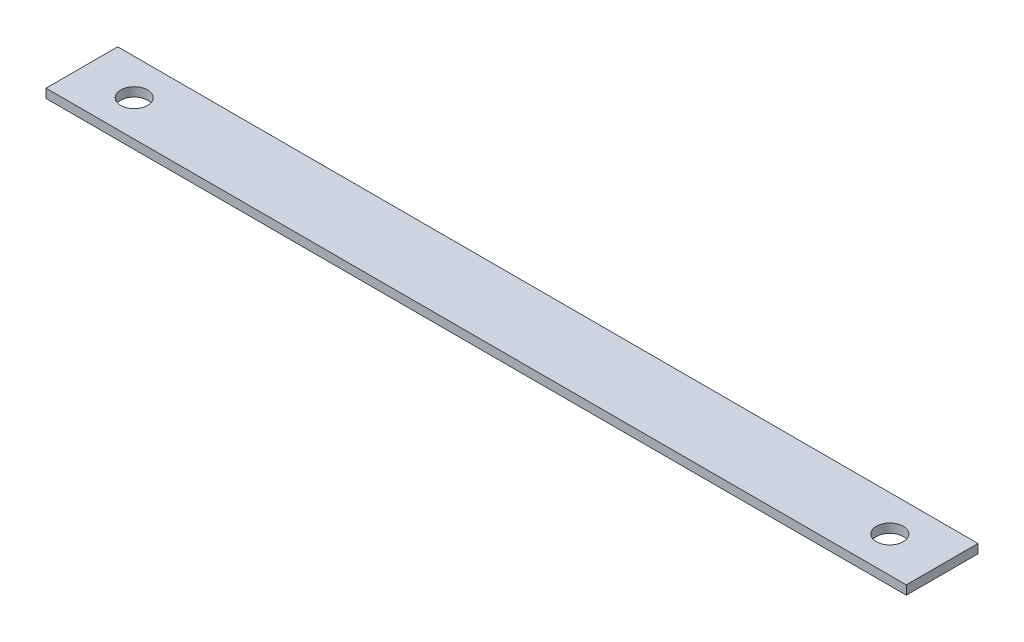
ISO-10303-21;
HEADER;
FILE_DESCRIPTION(('STEP AP214'),'2;1');
FILE_NAME('part.step','',(''),(''),'','','');
FILE_SCHEMA(('AUTOMOTIVE_DESIGN { 1 0 10303 214 1 1 1 1 }'));
ENDSEC;
DATA;
#1=APPLICATION_CONTEXT('core data for automotive mechanical design processes');
#2=APPLICATION_PROTOCOL_DEFINITION('international standard','automotive_design',2000,#1);
#3=PRODUCT_CONTEXT('',#1,'mechanical');
#4=PRODUCT('Part','Part','',(#3));
#5=PRODUCT_RELATED_PRODUCT_CATEGORY('part','',(#4));
#6=PRODUCT_DEFINITION_FORMATION('','',#4);
#7=PRODUCT_DEFINITION_CONTEXT('part definition',#1,'design');
#8=PRODUCT_DEFINITION('design','',#6,#7);
#9=PRODUCT_DEFINITION_SHAPE('','',#8);
#10=(LENGTH_UNIT() NAMED_UNIT(*) SI_UNIT(.MILLI.,.METRE.));
#11=(NAMED_UNIT(*) PLANE_ANGLE_UNIT() SI_UNIT($,.RADIAN.));
#12=(NAMED_UNIT(*) SI_UNIT($,.STERADIAN.) SOLID_ANGLE_UNIT());
#13=UNCERTAINTY_MEASURE_WITH_UNIT(LENGTH_MEASURE(1.E-05),#10,'distance_accuracy_value','');
#14=(GEOMETRIC_REPRESENTATION_CONTEXT(3) GLOBAL_UNCERTAINTY_ASSIGNED_CONTEXT((#13)) GLOBAL_UNIT_ASSIGNED_CONTEXT((#10,
#11,#12)) REPRESENTATION_CONTEXT('',''));
#15=CARTESIAN_POINT('',(0.,0.,0.));
#16=DIRECTION('',(0.,0.,1.));
#17=DIRECTION('',(1.,0.,0.));
#18=AXIS2_PLACEMENT_3D('',#15,#16,#17);
#19=CARTESIAN_POINT('',(152.4,3.175,-12.7));
#20=DIRECTION('',(-1.,0.,0.));
#21=DIRECTION('',(0.,0.,1.));
#22=AXIS2_PLACEMENT_3D('',#19,#20,#21);
#23=PLANE('',#22);
#24=DIRECTION('',(0.,0.,-1.));
#25=VECTOR('',#24,1.);
#26=CARTESIAN_POINT('',(152.4,0.,-12.7));
#27=LINE('',#26,#25);
#28=CARTESIAN_POINT('',(152.4,0.,12.7));
#29=VERTEX_POINT('',#28);
#30=CARTESIAN_POINT('',(152.4,0.,-12.7));
#31=VERTEX_POINT('',#30);
#32=EDGE_CURVE('E96',#29,#31,#27,.T.);
#33=ORIENTED_EDGE('',*,*,#32,.T.);
#34=DIRECTION('',(0.,-1.,0.));
#35=VECTOR('',#34,1.);
#36=CARTESIAN_POINT('',(152.4,3.175,-12.7));
#37=LINE('',#36,#35);
#38=CARTESIAN_POINT('',(152.4,3.175,-12.7));
#39=VERTEX_POINT('',#38);
#40=EDGE_CURVE('E11',#39,#31,#37,.T.);
#41=ORIENTED_EDGE('',*,*,#40,.F.);
#42=DIRECTION('',(0.,0.,-1.));
#43=VECTOR('',#42,1.);
#44=CARTESIAN_POINT('',(152.4,3.175,-12.7));
#45=LINE('',#44,#43);
#46=CARTESIAN_POINT('',(152.4,3.175,12.7));
#47=VERTEX_POINT('',#46);
#48=EDGE_CURVE('E84',#47,#39,#45,.T.);
#49=ORIENTED_EDGE('',*,*,#48,.F.);
#50=DIRECTION('',(0.,-1.,0.));
#51=VECTOR('',#50,1.);
#52=CARTESIAN_POINT('',(152.4,3.175,12.7));
#53=LINE('',#52,#51);
#54=EDGE_CURVE('E92',#47,#29,#53,.T.);
#55=ORIENTED_EDGE('',*,*,#54,.T.);
#56=EDGE_LOOP('',(#33,#41,#49,#55));
#57=FACE_BOUND('',#56,.T.);
#58=ADVANCED_FACE('F33',(#57),#23,.F.);
#59=CARTESIAN_POINT('',(-152.4,3.175,-12.7));
#60=DIRECTION('',(0.,0.,1.));
#61=DIRECTION('',(1.,0.,0.));
#62=AXIS2_PLACEMENT_3D('',#59,#60,#61);
#63=PLANE('',#62);
#64=DIRECTION('',(-1.,0.,0.));
#65=VECTOR('',#64,1.);
#66=CARTESIAN_POINT('',(-152.4,0.,-12.7));
#67=LINE('',#66,#65);
#68=CARTESIAN_POINT('',(-152.4,0.,-12.7));
#69=VERTEX_POINT('',#68);
#70=EDGE_CURVE('E88',#31,#69,#67,.T.);
#71=ORIENTED_EDGE('',*,*,#70,.T.);
#72=DIRECTION('',(0.,-1.,0.));
#73=VECTOR('',#72,1.);
#74=CARTESIAN_POINT('',(-152.4,3.175,-12.7));
#75=LINE('',#74,#73);
#76=CARTESIAN_POINT('',(-152.4,3.175,-12.7));
#77=VERTEX_POINT('',#76);
#78=EDGE_CURVE('E41',#77,#69,#75,.T.);
#79=ORIENTED_EDGE('',*,*,#78,.F.);
#80=DIRECTION('',(-1.,0.,0.));
#81=VECTOR('',#80,1.);
#82=CARTESIAN_POINT('',(-152.4,3.175,-12.7));
#83=LINE('',#82,#81);
#84=EDGE_CURVE('E79',#39,#77,#83,.T.);
#85=ORIENTED_EDGE('',*,*,#84,.F.);
#86=ORIENTED_EDGE('',*,*,#40,.T.);
#87=EDGE_LOOP('',(#71,#79,#85,#86));
#88=FACE_BOUND('',#87,.T.);
#89=ADVANCED_FACE('F87',(#88),#63,.F.);
#90=CARTESIAN_POINT('',(-152.4,3.175,-12.7));
#91=DIRECTION('',(1.,0.,0.));
#92=DIRECTION('',(0.,0.,-1.));
#93=AXIS2_PLACEMENT_3D('',#90,#91,#92);
#94=PLANE('',#93);
#95=DIRECTION('',(0.,0.,1.));
#96=VECTOR('',#95,1.);
#97=CARTESIAN_POINT('',(-152.4,0.,-12.7));
#98=LINE('',#97,#96);
#99=CARTESIAN_POINT('',(-152.4,0.,12.7));
#100=VERTEX_POINT('',#99);
#101=EDGE_CURVE('E66',#69,#100,#98,.T.);
#102=ORIENTED_EDGE('',*,*,#101,.T.);
#103=DIRECTION('',(0.,-1.,0.));
#104=VECTOR('',#103,1.);
#105=CARTESIAN_POINT('',(-152.4,3.175,12.7));
#106=LINE('',#105,#104);
#107=CARTESIAN_POINT('',(-152.4,3.175,12.7));
#108=VERTEX_POINT('',#107);
#109=EDGE_CURVE('E89',#108,#100,#106,.T.);
#110=ORIENTED_EDGE('',*,*,#109,.F.);
#111=DIRECTION('',(0.,0.,1.));
#112=VECTOR('',#111,1.);
#113=CARTESIAN_POINT('',(-152.4,3.175,-12.7));
#114=LINE('',#113,#112);
#115=EDGE_CURVE('E82',#77,#108,#114,.T.);
#116=ORIENTED_EDGE('',*,*,#115,.F.);
#117=ORIENTED_EDGE('',*,*,#78,.T.);
#118=EDGE_LOOP('',(#102,#110,#116,#117));
#119=FACE_BOUND('',#118,.T.);
#120=ADVANCED_FACE('F90',(#119),#94,.F.);
#121=CARTESIAN_POINT('',(-152.4,3.175,12.7));
#122=DIRECTION('',(0.,0.,-1.));
#123=DIRECTION('',(-1.,0.,0.));
#124=AXIS2_PLACEMENT_3D('',#121,#122,#123);
#125=PLANE('',#124);
#126=DIRECTION('',(1.,0.,0.));
#127=VECTOR('',#126,1.);
#128=CARTESIAN_POINT('',(-152.4,0.,12.7));
#129=LINE('',#128,#127);
#130=EDGE_CURVE('E72',#100,#29,#129,.T.);
#131=ORIENTED_EDGE('',*,*,#130,.T.);
#132=ORIENTED_EDGE('',*,*,#54,.F.);
#133=DIRECTION('',(1.,0.,0.));
#134=VECTOR('',#133,1.);
#135=CARTESIAN_POINT('',(-152.4,3.175,12.7));
#136=LINE('',#135,#134);
#137=EDGE_CURVE('E49',#108,#47,#136,.T.);
#138=ORIENTED_EDGE('',*,*,#137,.F.);
#139=ORIENTED_EDGE('',*,*,#109,.T.);
#140=EDGE_LOOP('',(#131,#132,#138,#139));
#141=FACE_BOUND('',#140,.T.);
#142=ADVANCED_FACE('F104',(#141),#125,.F.);
#143=CARTESIAN_POINT('',(0.,3.175,0.));
#144=DIRECTION('',(0.,1.,0.));
#145=DIRECTION('',(0.,0.,1.));
#146=AXIS2_PLACEMENT_3D('',#143,#144,#145);
#147=PLANE('',#146);
#148=CARTESIAN_POINT('',(-133.858,3.175,0.));
#149=DIRECTION('',(0.,1.,0.));
#150=DIRECTION('',(0.,0.,1.));
#151=AXIS2_PLACEMENT_3D('',#148,#149,#150);
#152=CIRCLE('',#151,4.76250000000001);
#153=CARTESIAN_POINT('',(-133.858,3.175,4.76250000000003));
#154=VERTEX_POINT('',#153);
#155=EDGE_CURVE('E116',#154,#154,#152,.T.);
#156=ORIENTED_EDGE('',*,*,#155,.F.);
#157=EDGE_LOOP('',(#156));
#158=FACE_BOUND('',#157,.T.);
#159=CARTESIAN_POINT('',(133.858,3.175,0.));
#160=DIRECTION('',(0.,1.,0.));
#161=DIRECTION('',(0.,0.,-1.));
#162=AXIS2_PLACEMENT_3D('',#159,#160,#161);
#163=CIRCLE('',#162,4.76250000000001);
#164=CARTESIAN_POINT('',(133.858,3.175,-4.76250000000003));
#165=VERTEX_POINT('',#164);
#166=EDGE_CURVE('E110',#165,#165,#163,.T.);
#167=ORIENTED_EDGE('',*,*,#166,.F.);
#168=EDGE_LOOP('',(#167));
#169=FACE_BOUND('',#168,.T.);
#170=ORIENTED_EDGE('',*,*,#48,.T.);
#171=ORIENTED_EDGE('',*,*,#84,.T.);
#172=ORIENTED_EDGE('',*,*,#115,.T.);
#173=ORIENTED_EDGE('',*,*,#137,.T.);
#174=EDGE_LOOP('',(#170,#171,#172,#173));
#175=FACE_BOUND('',#174,.T.);
#176=ADVANCED_FACE('F80',(#158,#169,#175),#147,.T.);
#177=CARTESIAN_POINT('',(0.,0.,0.));
#178=DIRECTION('',(0.,1.,0.));
#179=DIRECTION('',(0.,0.,1.));
#180=AXIS2_PLACEMENT_3D('',#177,#178,#179);
#181=PLANE('',#180);
#182=CARTESIAN_POINT('',(-133.858,0.,0.));
#183=DIRECTION('',(0.,1.,0.));
#184=DIRECTION('',(0.,0.,1.));
#185=AXIS2_PLACEMENT_3D('',#182,#183,#184);
#186=CIRCLE('',#185,4.76250000000001);
#187=CARTESIAN_POINT('',(-133.858,0.,4.76250000000003));
#188=VERTEX_POINT('',#187);
#189=EDGE_CURVE('E99',#188,#188,#186,.T.);
#190=ORIENTED_EDGE('',*,*,#189,.T.);
#191=EDGE_LOOP('',(#190));
#192=FACE_BOUND('',#191,.T.);
#193=CARTESIAN_POINT('',(133.858,0.,0.));
#194=DIRECTION('',(0.,1.,0.));
#195=DIRECTION('',(0.,0.,-1.));
#196=AXIS2_PLACEMENT_3D('',#193,#194,#195);
#197=CIRCLE('',#196,4.76250000000001);
#198=CARTESIAN_POINT('',(133.858,0.,-4.76250000000003));
#199=VERTEX_POINT('',#198);
#200=EDGE_CURVE('E113',#199,#199,#197,.T.);
#201=ORIENTED_EDGE('',*,*,#200,.T.);
#202=EDGE_LOOP('',(#201));
#203=FACE_BOUND('',#202,.T.);
#204=ORIENTED_EDGE('',*,*,#32,.F.);
#205=ORIENTED_EDGE('',*,*,#130,.F.);
#206=ORIENTED_EDGE('',*,*,#101,.F.);
#207=ORIENTED_EDGE('',*,*,#70,.F.);
#208=EDGE_LOOP('',(#204,#205,#206,#207));
#209=FACE_BOUND('',#208,.T.);
#210=ADVANCED_FACE('F107',(#192,#203,#209),#181,.F.);
#211=CARTESIAN_POINT('',(133.858,0.,0.));
#212=DIRECTION('',(0.,1.,0.));
#213=DIRECTION('',(0.,0.,1.));
#214=AXIS2_PLACEMENT_3D('',#211,#212,#213);
#215=CYLINDRICAL_SURFACE('',#214,4.76250000000001);
#216=ORIENTED_EDGE('',*,*,#200,.F.);
#217=EDGE_LOOP('',(#216));
#218=FACE_BOUND('',#217,.T.);
#219=ORIENTED_EDGE('',*,*,#166,.T.);
#220=EDGE_LOOP('',(#219));
#221=FACE_BOUND('',#220,.T.);
#222=ADVANCED_FACE('F127',(#218,#221),#215,.F.);
#223=CARTESIAN_POINT('',(-133.858,0.,0.));
#224=DIRECTION('',(0.,1.,0.));
#225=DIRECTION('',(0.,0.,1.));
#226=AXIS2_PLACEMENT_3D('',#223,#224,#225);
#227=CYLINDRICAL_SURFACE('',#226,4.76250000000001);
#228=ORIENTED_EDGE('',*,*,#189,.F.);
#229=EDGE_LOOP('',(#228));
#230=FACE_BOUND('',#229,.T.);
#231=ORIENTED_EDGE('',*,*,#155,.T.);
#232=EDGE_LOOP('',(#231));
#233=FACE_BOUND('',#232,.T.);
#234=ADVANCED_FACE('F124',(#230,#233),#227,.F.);
#235=CLOSED_SHELL('',(#58,#89,#120,#142,#176,#210,#222,#234));
#236=MANIFOLD_SOLID_BREP('B2',#235);
#237=ADVANCED_BREP_SHAPE_REPRESENTATION('',(#18,#236),#14);
#238=SHAPE_DEFINITION_REPRESENTATION(#9,#237);
ENDSEC;
END-ISO-10303-21;
